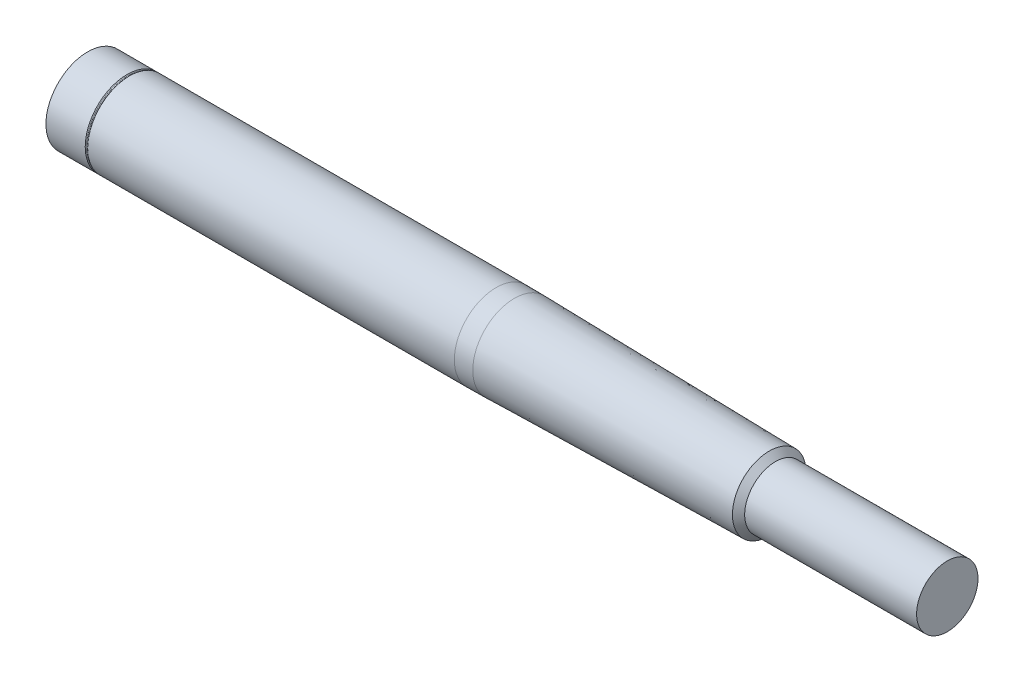
ISO-10303-21;
HEADER;
FILE_DESCRIPTION(('STEP AP214'),'2;1');
FILE_NAME('part.step','',(''),(''),'','','');
FILE_SCHEMA(('AUTOMOTIVE_DESIGN { 1 0 10303 214 1 1 1 1 }'));
ENDSEC;
DATA;
#1=APPLICATION_CONTEXT('core data for automotive mechanical design processes');
#2=APPLICATION_PROTOCOL_DEFINITION('international standard','automotive_design',2000,#1);
#3=PRODUCT_CONTEXT('',#1,'mechanical');
#4=PRODUCT('Part','Part','',(#3));
#5=PRODUCT_RELATED_PRODUCT_CATEGORY('part','',(#4));
#6=PRODUCT_DEFINITION_FORMATION('','',#4);
#7=PRODUCT_DEFINITION_CONTEXT('part definition',#1,'design');
#8=PRODUCT_DEFINITION('design','',#6,#7);
#9=PRODUCT_DEFINITION_SHAPE('','',#8);
#10=(LENGTH_UNIT() NAMED_UNIT(*) SI_UNIT(.MILLI.,.METRE.));
#11=(NAMED_UNIT(*) PLANE_ANGLE_UNIT() SI_UNIT($,.RADIAN.));
#12=(NAMED_UNIT(*) SI_UNIT($,.STERADIAN.) SOLID_ANGLE_UNIT());
#13=UNCERTAINTY_MEASURE_WITH_UNIT(LENGTH_MEASURE(1.E-05),#10,'distance_accuracy_value','');
#14=(GEOMETRIC_REPRESENTATION_CONTEXT(3) GLOBAL_UNCERTAINTY_ASSIGNED_CONTEXT((#13)) GLOBAL_UNIT_ASSIGNED_CONTEXT((#10,
#11,#12)) REPRESENTATION_CONTEXT('',''));
#15=CARTESIAN_POINT('',(0.,0.,0.));
#16=DIRECTION('',(0.,0.,1.));
#17=DIRECTION('',(1.,0.,0.));
#18=AXIS2_PLACEMENT_3D('',#15,#16,#17);
#19=CARTESIAN_POINT('',(0.,0.,0.));
#20=DIRECTION('',(1.,0.,0.));
#21=DIRECTION('',(0.,0.,-1.));
#22=AXIS2_PLACEMENT_3D('',#19,#20,#21);
#23=CYLINDRICAL_SURFACE('',#22,8.5);
#24=CARTESIAN_POINT('',(83.1396958479778,0.,0.));
#25=DIRECTION('',(1.,0.,0.));
#26=DIRECTION('',(0.,0.,-1.));
#27=AXIS2_PLACEMENT_3D('',#24,#25,#26);
#28=CIRCLE('',#27,8.5);
#29=CARTESIAN_POINT('',(83.1396958479778,0.,-8.5));
#30=VERTEX_POINT('',#29);
#31=EDGE_CURVE('E55',#30,#30,#28,.T.);
#32=ORIENTED_EDGE('',*,*,#31,.F.);
#33=EDGE_LOOP('',(#32));
#34=FACE_BOUND('',#33,.T.);
#35=CARTESIAN_POINT('',(8.5,0.,0.));
#36=DIRECTION('',(-1.,0.,0.));
#37=DIRECTION('',(0.,0.,1.));
#38=AXIS2_PLACEMENT_3D('',#35,#36,#37);
#39=CIRCLE('',#38,8.5);
#40=CARTESIAN_POINT('',(8.5,0.,8.5));
#41=VERTEX_POINT('',#40);
#42=EDGE_CURVE('E61',#41,#41,#39,.T.);
#43=ORIENTED_EDGE('',*,*,#42,.F.);
#44=EDGE_LOOP('',(#43));
#45=FACE_BOUND('',#44,.T.);
#46=ADVANCED_FACE('F35',(#34,#45),#23,.T.);
#47=CARTESIAN_POINT('',(175.,0.,0.));
#48=DIRECTION('',(1.,0.,0.));
#49=DIRECTION('',(0.,0.,-1.));
#50=AXIS2_PLACEMENT_3D('',#47,#48,#49);
#51=PLANE('',#50);
#52=CARTESIAN_POINT('',(175.,0.,0.));
#53=DIRECTION('',(1.,0.,0.));
#54=DIRECTION('',(0.,0.,-1.));
#55=AXIS2_PLACEMENT_3D('',#52,#53,#54);
#56=CIRCLE('',#55,6.25000000000002);
#57=CARTESIAN_POINT('',(175.,0.,-6.25000000000002));
#58=VERTEX_POINT('',#57);
#59=EDGE_CURVE('E10',#58,#58,#56,.T.);
#60=ORIENTED_EDGE('',*,*,#59,.T.);
#61=EDGE_LOOP('',(#60));
#62=FACE_BOUND('',#61,.T.);
#63=ADVANCED_FACE('F37',(#62),#51,.T.);
#64=CARTESIAN_POINT('',(0.,0.,0.));
#65=DIRECTION('',(1.,0.,0.));
#66=DIRECTION('',(0.,0.,-1.));
#67=AXIS2_PLACEMENT_3D('',#64,#65,#66);
#68=CYLINDRICAL_SURFACE('',#67,6.25000000000002);
#69=CARTESIAN_POINT('',(140.,0.,0.));
#70=DIRECTION('',(1.,0.,0.));
#71=DIRECTION('',(0.,0.,-1.));
#72=AXIS2_PLACEMENT_3D('',#69,#70,#71);
#73=CIRCLE('',#72,6.25000000000002);
#74=CARTESIAN_POINT('',(140.,0.,-6.25000000000002));
#75=VERTEX_POINT('',#74);
#76=EDGE_CURVE('E42',#75,#75,#73,.T.);
#77=ORIENTED_EDGE('',*,*,#76,.T.);
#78=EDGE_LOOP('',(#77));
#79=FACE_BOUND('',#78,.T.);
#80=ORIENTED_EDGE('',*,*,#59,.F.);
#81=EDGE_LOOP('',(#80));
#82=FACE_BOUND('',#81,.T.);
#83=ADVANCED_FACE('F97',(#79,#82),#68,.T.);
#84=CARTESIAN_POINT('',(140.,0.,0.));
#85=DIRECTION('',(-1.,0.,0.));
#86=DIRECTION('',(0.,0.,1.));
#87=AXIS2_PLACEMENT_3D('',#84,#85,#86);
#88=CONICAL_SURFACE('',#87,6.25000000000002,0.785398163397425);
#89=CARTESIAN_POINT('',(138.75,0.,0.));
#90=DIRECTION('',(1.,0.,0.));
#91=DIRECTION('',(0.,0.,-1.));
#92=AXIS2_PLACEMENT_3D('',#89,#90,#91);
#93=CIRCLE('',#92,7.50000000000002);
#94=CARTESIAN_POINT('',(138.75,0.,-7.50000000000002));
#95=VERTEX_POINT('',#94);
#96=EDGE_CURVE('E46',#95,#95,#93,.T.);
#97=ORIENTED_EDGE('',*,*,#96,.T.);
#98=EDGE_LOOP('',(#97));
#99=FACE_BOUND('',#98,.T.);
#100=ORIENTED_EDGE('',*,*,#76,.F.);
#101=EDGE_LOOP('',(#100));
#102=FACE_BOUND('',#101,.T.);
#103=ADVANCED_FACE('F163',(#99,#102),#88,.T.);
#104=CARTESIAN_POINT('',(138.75,0.,0.));
#105=DIRECTION('',(-1.,0.,0.));
#106=DIRECTION('',(0.,0.,1.));
#107=AXIS2_PLACEMENT_3D('',#104,#105,#106);
#108=CONICAL_SURFACE('',#107,7.50000000000002,0.0186025050469588);
#109=CARTESIAN_POINT('',(86.8599822792076,0.,0.));
#110=DIRECTION('',(1.,0.,0.));
#111=DIRECTION('',(0.,0.,-1.));
#112=AXIS2_PLACEMENT_3D('',#109,#110,#111);
#113=CIRCLE('',#112,8.46539567852636);
#114=CARTESIAN_POINT('',(86.8599822792076,0.,-8.46539567852636));
#115=VERTEX_POINT('',#114);
#116=EDGE_CURVE('E50',#115,#115,#113,.T.);
#117=ORIENTED_EDGE('',*,*,#116,.T.);
#118=EDGE_LOOP('',(#117));
#119=FACE_BOUND('',#118,.T.);
#120=ORIENTED_EDGE('',*,*,#96,.F.);
#121=EDGE_LOOP('',(#120));
#122=FACE_BOUND('',#121,.T.);
#123=ADVANCED_FACE('F158',(#119,#122),#108,.T.);
#124=CARTESIAN_POINT('',(83.1396958479772,0.,0.));
#125=DIRECTION('',(1.,0.,0.));
#126=DIRECTION('',(0.,0.,-1.));
#127=AXIS2_PLACEMENT_3D('',#124,#125,#126);
#128=DEGENERATE_TOROIDAL_SURFACE('',#127,191.5,200.,.F.);
#129=ORIENTED_EDGE('',*,*,#31,.T.);
#130=EDGE_LOOP('',(#129));
#131=FACE_BOUND('',#130,.T.);
#132=ORIENTED_EDGE('',*,*,#116,.F.);
#133=EDGE_LOOP('',(#132));
#134=FACE_BOUND('',#133,.T.);
#135=ADVANCED_FACE('F119',(#131,#134),#128,.F.);
#136=CARTESIAN_POINT('',(8.35606601717798,0.,0.));
#137=DIRECTION('',(1.,0.,0.));
#138=DIRECTION('',(0.,0.,-1.));
#139=AXIS2_PLACEMENT_3D('',#136,#137,#138);
#140=CONICAL_SURFACE('',#139,8.35606601717798,0.785398163397448);
#141=ORIENTED_EDGE('',*,*,#42,.T.);
#142=EDGE_LOOP('',(#141));
#143=FACE_BOUND('',#142,.T.);
#144=CARTESIAN_POINT('',(8.35606601717798,0.,0.));
#145=DIRECTION('',(-1.,0.,0.));
#146=DIRECTION('',(0.,0.,1.));
#147=AXIS2_PLACEMENT_3D('',#144,#145,#146);
#148=CIRCLE('',#147,8.35606601717798);
#149=CARTESIAN_POINT('',(8.35606601717798,0.,8.35606601717798));
#150=VERTEX_POINT('',#149);
#151=EDGE_CURVE('E64',#150,#150,#148,.T.);
#152=ORIENTED_EDGE('',*,*,#151,.F.);
#153=EDGE_LOOP('',(#152));
#154=FACE_BOUND('',#153,.T.);
#155=ADVANCED_FACE('F88',(#143,#154),#140,.T.);
#156=CARTESIAN_POINT('',(8.25,0.,0.));
#157=DIRECTION('',(-1.,0.,0.));
#158=DIRECTION('',(0.,0.,1.));
#159=AXIS2_PLACEMENT_3D('',#156,#157,#158);
#160=TOROIDAL_SURFACE('',#159,8.46213203435596,0.149999999999999);
#161=ORIENTED_EDGE('',*,*,#151,.T.);
#162=EDGE_LOOP('',(#161));
#163=FACE_BOUND('',#162,.T.);
#164=CARTESIAN_POINT('',(8.14393398282202,0.,0.));
#165=DIRECTION('',(-1.,0.,0.));
#166=DIRECTION('',(0.,0.,1.));
#167=AXIS2_PLACEMENT_3D('',#164,#165,#166);
#168=CIRCLE('',#167,8.35606601717798);
#169=CARTESIAN_POINT('',(8.14393398282202,0.,8.35606601717798));
#170=VERTEX_POINT('',#169);
#171=EDGE_CURVE('E67',#170,#170,#168,.T.);
#172=ORIENTED_EDGE('',*,*,#171,.F.);
#173=EDGE_LOOP('',(#172));
#174=FACE_BOUND('',#173,.T.);
#175=ADVANCED_FACE('F79',(#163,#174),#160,.F.);
#176=CARTESIAN_POINT('',(8.,0.,0.));
#177=DIRECTION('',(-1.,0.,0.));
#178=DIRECTION('',(0.,0.,1.));
#179=AXIS2_PLACEMENT_3D('',#176,#177,#178);
#180=CONICAL_SURFACE('',#179,8.5,0.785398163397448);
#181=ORIENTED_EDGE('',*,*,#171,.T.);
#182=EDGE_LOOP('',(#181));
#183=FACE_BOUND('',#182,.T.);
#184=CARTESIAN_POINT('',(8.,0.,0.));
#185=DIRECTION('',(-1.,0.,0.));
#186=DIRECTION('',(0.,0.,1.));
#187=AXIS2_PLACEMENT_3D('',#184,#185,#186);
#188=CIRCLE('',#187,8.5);
#189=CARTESIAN_POINT('',(8.,0.,8.5));
#190=VERTEX_POINT('',#189);
#191=EDGE_CURVE('E70',#190,#190,#188,.T.);
#192=ORIENTED_EDGE('',*,*,#191,.F.);
#193=EDGE_LOOP('',(#192));
#194=FACE_BOUND('',#193,.T.);
#195=ADVANCED_FACE('F76',(#183,#194),#180,.T.);
#196=CARTESIAN_POINT('',(0.,0.,-8.5));
#197=DIRECTION('',(-1.,0.,0.));
#198=DIRECTION('',(0.,0.,1.));
#199=AXIS2_PLACEMENT_3D('',#196,#197,#198);
#200=PLANE('',#199);
#201=CARTESIAN_POINT('',(0.,0.,0.));
#202=DIRECTION('',(1.,0.,0.));
#203=DIRECTION('',(0.,0.,-1.));
#204=AXIS2_PLACEMENT_3D('',#201,#202,#203);
#205=CIRCLE('',#204,8.5);
#206=CARTESIAN_POINT('',(0.,0.,-8.5));
#207=VERTEX_POINT('',#206);
#208=EDGE_CURVE('E58',#207,#207,#205,.T.);
#209=ORIENTED_EDGE('',*,*,#208,.F.);
#210=EDGE_LOOP('',(#209));
#211=FACE_BOUND('',#210,.T.);
#212=ADVANCED_FACE('F78',(#211),#200,.T.);
#213=ORIENTED_EDGE('',*,*,#208,.T.);
#214=EDGE_LOOP('',(#213));
#215=FACE_BOUND('',#214,.T.);
#216=ORIENTED_EDGE('',*,*,#191,.T.);
#217=EDGE_LOOP('',(#216));
#218=FACE_BOUND('',#217,.T.);
#219=ADVANCED_FACE('F74',(#215,#218),#23,.T.);
#220=CLOSED_SHELL('',(#46,#63,#83,#103,#123,#135,#155,#175,#195,#212,#219));
#221=MANIFOLD_SOLID_BREP('B2',#220);
#222=ADVANCED_BREP_SHAPE_REPRESENTATION('',(#18,#221),#14);
#223=SHAPE_DEFINITION_REPRESENTATION(#9,#222);
ENDSEC;
END-ISO-10303-21;
